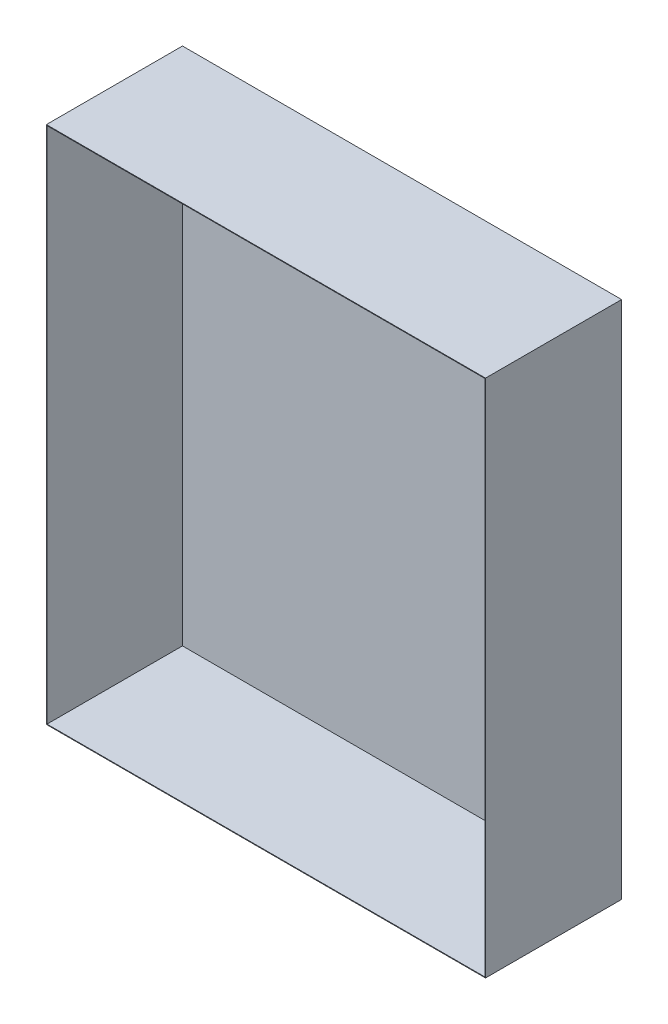
ISO-10303-21;
HEADER;
FILE_DESCRIPTION(('STEP AP214'),'2;1');
FILE_NAME('part.step','',(''),(''),'','','');
FILE_SCHEMA(('AUTOMOTIVE_DESIGN { 1 0 10303 214 1 1 1 1 }'));
ENDSEC;
DATA;
#1=APPLICATION_CONTEXT('core data for automotive mechanical design processes');
#2=APPLICATION_PROTOCOL_DEFINITION('international standard','automotive_design',2000,#1);
#3=PRODUCT_CONTEXT('',#1,'mechanical');
#4=PRODUCT('Part','Part','',(#3));
#5=PRODUCT_RELATED_PRODUCT_CATEGORY('part','',(#4));
#6=PRODUCT_DEFINITION_FORMATION('','',#4);
#7=PRODUCT_DEFINITION_CONTEXT('part definition',#1,'design');
#8=PRODUCT_DEFINITION('design','',#6,#7);
#9=PRODUCT_DEFINITION_SHAPE('','',#8);
#10=(LENGTH_UNIT() NAMED_UNIT(*) SI_UNIT(.MILLI.,.METRE.));
#11=(NAMED_UNIT(*) PLANE_ANGLE_UNIT() SI_UNIT($,.RADIAN.));
#12=(NAMED_UNIT(*) SI_UNIT($,.STERADIAN.) SOLID_ANGLE_UNIT());
#13=UNCERTAINTY_MEASURE_WITH_UNIT(LENGTH_MEASURE(1.E-05),#10,'distance_accuracy_value','');
#14=(GEOMETRIC_REPRESENTATION_CONTEXT(3) GLOBAL_UNCERTAINTY_ASSIGNED_CONTEXT((#13)) GLOBAL_UNIT_ASSIGNED_CONTEXT((#10,
#11,#12)) REPRESENTATION_CONTEXT('',''));
#15=CARTESIAN_POINT('',(0.,0.,0.));
#16=DIRECTION('',(0.,0.,1.));
#17=DIRECTION('',(1.,0.,0.));
#18=AXIS2_PLACEMENT_3D('',#15,#16,#17);
#19=CARTESIAN_POINT('',(-901.7,2133.6,279.4));
#20=DIRECTION('',(0.,0.,-1.));
#21=DIRECTION('',(-1.,0.,0.));
#22=AXIS2_PLACEMENT_3D('',#19,#20,#21);
#23=PLANE('',#22);
#24=DIRECTION('',(1.,0.,0.));
#25=VECTOR('',#24,1.);
#26=CARTESIAN_POINT('',(-901.7,0.,279.4));
#27=LINE('',#26,#25);
#28=CARTESIAN_POINT('',(-901.7,0.,279.4));
#29=VERTEX_POINT('',#28);
#30=CARTESIAN_POINT('',(901.7,0.,279.4));
#31=VERTEX_POINT('',#30);
#32=EDGE_CURVE('E79',#29,#31,#27,.T.);
#33=ORIENTED_EDGE('',*,*,#32,.T.);
#34=DIRECTION('',(0.,-1.,0.));
#35=VECTOR('',#34,1.);
#36=CARTESIAN_POINT('',(901.7,2133.6,279.4));
#37=LINE('',#36,#35);
#38=CARTESIAN_POINT('',(901.7,2133.6,279.4));
#39=VERTEX_POINT('',#38);
#40=EDGE_CURVE('E151',#39,#31,#37,.T.);
#41=ORIENTED_EDGE('',*,*,#40,.F.);
#42=DIRECTION('',(1.,0.,0.));
#43=VECTOR('',#42,1.);
#44=CARTESIAN_POINT('',(-901.7,2133.6,279.4));
#45=LINE('',#44,#43);
#46=CARTESIAN_POINT('',(-901.7,2133.6,279.4));
#47=VERTEX_POINT('',#46);
#48=EDGE_CURVE('E58',#47,#39,#45,.T.);
#49=ORIENTED_EDGE('',*,*,#48,.F.);
#50=DIRECTION('',(0.,-1.,0.));
#51=VECTOR('',#50,1.);
#52=CARTESIAN_POINT('',(-901.7,2133.6,279.4));
#53=LINE('',#52,#51);
#54=EDGE_CURVE('E161',#47,#29,#53,.T.);
#55=ORIENTED_EDGE('',*,*,#54,.T.);
#56=EDGE_LOOP('',(#33,#41,#49,#55));
#57=FACE_BOUND('',#56,.T.);
#58=DIRECTION('',(1.,0.,0.));
#59=VECTOR('',#58,1.);
#60=CARTESIAN_POINT('',(0.,2.54,279.4));
#61=LINE('',#60,#59);
#62=CARTESIAN_POINT('',(-899.16,2.54,279.4));
#63=VERTEX_POINT('',#62);
#64=CARTESIAN_POINT('',(899.16,2.54,279.4));
#65=VERTEX_POINT('',#64);
#66=EDGE_CURVE('E132',#63,#65,#61,.T.);
#67=ORIENTED_EDGE('',*,*,#66,.F.);
#68=DIRECTION('',(0.,-1.,0.));
#69=VECTOR('',#68,1.);
#70=CARTESIAN_POINT('',(-899.16,2133.6,279.4));
#71=LINE('',#70,#69);
#72=CARTESIAN_POINT('',(-899.16,2131.06,279.4));
#73=VERTEX_POINT('',#72);
#74=EDGE_CURVE('E127',#73,#63,#71,.T.);
#75=ORIENTED_EDGE('',*,*,#74,.F.);
#76=DIRECTION('',(1.,0.,0.));
#77=VECTOR('',#76,1.);
#78=CARTESIAN_POINT('',(0.,2131.06,279.4));
#79=LINE('',#78,#77);
#80=CARTESIAN_POINT('',(899.16,2131.06,279.4));
#81=VERTEX_POINT('',#80);
#82=EDGE_CURVE('E49',#73,#81,#79,.T.);
#83=ORIENTED_EDGE('',*,*,#82,.T.);
#84=DIRECTION('',(0.,-1.,0.));
#85=VECTOR('',#84,1.);
#86=CARTESIAN_POINT('',(899.16,2133.6,279.4));
#87=LINE('',#86,#85);
#88=EDGE_CURVE('E140',#81,#65,#87,.T.);
#89=ORIENTED_EDGE('',*,*,#88,.T.);
#90=EDGE_LOOP('',(#67,#75,#83,#89));
#91=FACE_BOUND('',#90,.T.);
#92=ADVANCED_FACE('F34',(#57,#91),#23,.F.);
#93=CARTESIAN_POINT('',(901.7,2133.6,279.4));
#94=DIRECTION('',(-1.,0.,0.));
#95=DIRECTION('',(0.,0.,1.));
#96=AXIS2_PLACEMENT_3D('',#93,#94,#95);
#97=PLANE('',#96);
#98=DIRECTION('',(0.,0.,-1.));
#99=VECTOR('',#98,1.);
#100=CARTESIAN_POINT('',(901.7,0.,279.4));
#101=LINE('',#100,#99);
#102=CARTESIAN_POINT('',(901.7,0.,-279.4));
#103=VERTEX_POINT('',#102);
#104=EDGE_CURVE('E152',#31,#103,#101,.T.);
#105=ORIENTED_EDGE('',*,*,#104,.T.);
#106=DIRECTION('',(0.,-1.,0.));
#107=VECTOR('',#106,1.);
#108=CARTESIAN_POINT('',(901.7,2133.6,-279.4));
#109=LINE('',#108,#107);
#110=CARTESIAN_POINT('',(901.7,2133.6,-279.4));
#111=VERTEX_POINT('',#110);
#112=EDGE_CURVE('E11',#111,#103,#109,.T.);
#113=ORIENTED_EDGE('',*,*,#112,.F.);
#114=DIRECTION('',(0.,0.,-1.));
#115=VECTOR('',#114,1.);
#116=CARTESIAN_POINT('',(901.7,2133.6,279.4));
#117=LINE('',#116,#115);
#118=EDGE_CURVE('E145',#39,#111,#117,.T.);
#119=ORIENTED_EDGE('',*,*,#118,.F.);
#120=ORIENTED_EDGE('',*,*,#40,.T.);
#121=EDGE_LOOP('',(#105,#113,#119,#120));
#122=FACE_BOUND('',#121,.T.);
#123=ADVANCED_FACE('F36',(#122),#97,.F.);
#124=CARTESIAN_POINT('',(-901.7,2133.6,-279.4));
#125=DIRECTION('',(0.,0.,1.));
#126=DIRECTION('',(1.,0.,0.));
#127=AXIS2_PLACEMENT_3D('',#124,#125,#126);
#128=PLANE('',#127);
#129=DIRECTION('',(-1.,0.,0.));
#130=VECTOR('',#129,1.);
#131=CARTESIAN_POINT('',(-901.7,0.,-279.4));
#132=LINE('',#131,#130);
#133=CARTESIAN_POINT('',(-901.7,0.,-279.4));
#134=VERTEX_POINT('',#133);
#135=EDGE_CURVE('E155',#103,#134,#132,.T.);
#136=ORIENTED_EDGE('',*,*,#135,.T.);
#137=DIRECTION('',(0.,-1.,0.));
#138=VECTOR('',#137,1.);
#139=CARTESIAN_POINT('',(-901.7,2133.6,-279.4));
#140=LINE('',#139,#138);
#141=CARTESIAN_POINT('',(-901.7,2133.6,-279.4));
#142=VERTEX_POINT('',#141);
#143=EDGE_CURVE('E42',#142,#134,#140,.T.);
#144=ORIENTED_EDGE('',*,*,#143,.F.);
#145=DIRECTION('',(-1.,0.,0.));
#146=VECTOR('',#145,1.);
#147=CARTESIAN_POINT('',(-901.7,2133.6,-279.4));
#148=LINE('',#147,#146);
#149=EDGE_CURVE('E86',#111,#142,#148,.T.);
#150=ORIENTED_EDGE('',*,*,#149,.F.);
#151=ORIENTED_EDGE('',*,*,#112,.T.);
#152=EDGE_LOOP('',(#136,#144,#150,#151));
#153=FACE_BOUND('',#152,.T.);
#154=ADVANCED_FACE('F200',(#153),#128,.F.);
#155=CARTESIAN_POINT('',(-901.7,2133.6,279.4));
#156=DIRECTION('',(1.,0.,0.));
#157=DIRECTION('',(0.,0.,-1.));
#158=AXIS2_PLACEMENT_3D('',#155,#156,#157);
#159=PLANE('',#158);
#160=DIRECTION('',(0.,0.,1.));
#161=VECTOR('',#160,1.);
#162=CARTESIAN_POINT('',(-901.7,0.,279.4));
#163=LINE('',#162,#161);
#164=EDGE_CURVE('E157',#134,#29,#163,.T.);
#165=ORIENTED_EDGE('',*,*,#164,.T.);
#166=ORIENTED_EDGE('',*,*,#54,.F.);
#167=DIRECTION('',(0.,0.,1.));
#168=VECTOR('',#167,1.);
#169=CARTESIAN_POINT('',(-901.7,2133.6,279.4));
#170=LINE('',#169,#168);
#171=EDGE_CURVE('E148',#142,#47,#170,.T.);
#172=ORIENTED_EDGE('',*,*,#171,.F.);
#173=ORIENTED_EDGE('',*,*,#143,.T.);
#174=EDGE_LOOP('',(#165,#166,#172,#173));
#175=FACE_BOUND('',#174,.T.);
#176=ADVANCED_FACE('F166',(#175),#159,.F.);
#177=CARTESIAN_POINT('',(0.,2133.6,0.));
#178=DIRECTION('',(0.,-1.,0.));
#179=DIRECTION('',(0.,0.,-1.));
#180=AXIS2_PLACEMENT_3D('',#177,#178,#179);
#181=PLANE('',#180);
#182=ORIENTED_EDGE('',*,*,#118,.T.);
#183=ORIENTED_EDGE('',*,*,#149,.T.);
#184=ORIENTED_EDGE('',*,*,#171,.T.);
#185=ORIENTED_EDGE('',*,*,#48,.T.);
#186=EDGE_LOOP('',(#182,#183,#184,#185));
#187=FACE_BOUND('',#186,.T.);
#188=ADVANCED_FACE('F194',(#187),#181,.F.);
#189=CARTESIAN_POINT('',(0.,0.,0.));
#190=DIRECTION('',(0.,-1.,0.));
#191=DIRECTION('',(0.,0.,-1.));
#192=AXIS2_PLACEMENT_3D('',#189,#190,#191);
#193=PLANE('',#192);
#194=ORIENTED_EDGE('',*,*,#104,.F.);
#195=ORIENTED_EDGE('',*,*,#32,.F.);
#196=ORIENTED_EDGE('',*,*,#164,.F.);
#197=ORIENTED_EDGE('',*,*,#135,.F.);
#198=EDGE_LOOP('',(#194,#195,#196,#197));
#199=FACE_BOUND('',#198,.T.);
#200=ADVANCED_FACE('F170',(#199),#193,.T.);
#201=CARTESIAN_POINT('',(899.16,2133.6,279.4));
#202=DIRECTION('',(-1.,0.,0.));
#203=DIRECTION('',(0.,0.,1.));
#204=AXIS2_PLACEMENT_3D('',#201,#202,#203);
#205=PLANE('',#204);
#206=DIRECTION('',(0.,0.,-1.));
#207=VECTOR('',#206,1.);
#208=CARTESIAN_POINT('',(899.16,2.54,0.));
#209=LINE('',#208,#207);
#210=CARTESIAN_POINT('',(899.16,2.54,-276.86));
#211=VERTEX_POINT('',#210);
#212=EDGE_CURVE('E116',#65,#211,#209,.T.);
#213=ORIENTED_EDGE('',*,*,#212,.F.);
#214=ORIENTED_EDGE('',*,*,#88,.F.);
#215=DIRECTION('',(0.,0.,-1.));
#216=VECTOR('',#215,1.);
#217=CARTESIAN_POINT('',(899.16,2131.06,0.));
#218=LINE('',#217,#216);
#219=CARTESIAN_POINT('',(899.16,2131.06,-276.86));
#220=VERTEX_POINT('',#219);
#221=EDGE_CURVE('E134',#81,#220,#218,.T.);
#222=ORIENTED_EDGE('',*,*,#221,.T.);
#223=DIRECTION('',(0.,-1.,0.));
#224=VECTOR('',#223,1.);
#225=CARTESIAN_POINT('',(899.16,2133.6,-276.86));
#226=LINE('',#225,#224);
#227=EDGE_CURVE('E126',#220,#211,#226,.T.);
#228=ORIENTED_EDGE('',*,*,#227,.T.);
#229=EDGE_LOOP('',(#213,#214,#222,#228));
#230=FACE_BOUND('',#229,.T.);
#231=ADVANCED_FACE('F178',(#230),#205,.T.);
#232=CARTESIAN_POINT('',(-901.7,2133.6,-276.86));
#233=DIRECTION('',(0.,0.,1.));
#234=DIRECTION('',(1.,0.,0.));
#235=AXIS2_PLACEMENT_3D('',#232,#233,#234);
#236=PLANE('',#235);
#237=DIRECTION('',(-1.,0.,0.));
#238=VECTOR('',#237,1.);
#239=CARTESIAN_POINT('',(0.,2.54,-276.86));
#240=LINE('',#239,#238);
#241=CARTESIAN_POINT('',(-899.16,2.54,-276.86));
#242=VERTEX_POINT('',#241);
#243=EDGE_CURVE('E109',#211,#242,#240,.T.);
#244=ORIENTED_EDGE('',*,*,#243,.F.);
#245=ORIENTED_EDGE('',*,*,#227,.F.);
#246=DIRECTION('',(-1.,0.,0.));
#247=VECTOR('',#246,1.);
#248=CARTESIAN_POINT('',(0.,2131.06,-276.86));
#249=LINE('',#248,#247);
#250=CARTESIAN_POINT('',(-899.16,2131.06,-276.86));
#251=VERTEX_POINT('',#250);
#252=EDGE_CURVE('E124',#220,#251,#249,.T.);
#253=ORIENTED_EDGE('',*,*,#252,.T.);
#254=DIRECTION('',(0.,-1.,0.));
#255=VECTOR('',#254,1.);
#256=CARTESIAN_POINT('',(-899.16,2133.6,-276.86));
#257=LINE('',#256,#255);
#258=EDGE_CURVE('E122',#251,#242,#257,.T.);
#259=ORIENTED_EDGE('',*,*,#258,.T.);
#260=EDGE_LOOP('',(#244,#245,#253,#259));
#261=FACE_BOUND('',#260,.T.);
#262=ADVANCED_FACE('F123',(#261),#236,.T.);
#263=CARTESIAN_POINT('',(-899.16,2133.6,279.4));
#264=DIRECTION('',(1.,0.,0.));
#265=DIRECTION('',(0.,0.,-1.));
#266=AXIS2_PLACEMENT_3D('',#263,#264,#265);
#267=PLANE('',#266);
#268=DIRECTION('',(0.,0.,1.));
#269=VECTOR('',#268,1.);
#270=CARTESIAN_POINT('',(-899.16,2.54,0.));
#271=LINE('',#270,#269);
#272=EDGE_CURVE('E113',#242,#63,#271,.T.);
#273=ORIENTED_EDGE('',*,*,#272,.F.);
#274=ORIENTED_EDGE('',*,*,#258,.F.);
#275=DIRECTION('',(0.,0.,1.));
#276=VECTOR('',#275,1.);
#277=CARTESIAN_POINT('',(-899.16,2131.06,0.));
#278=LINE('',#277,#276);
#279=EDGE_CURVE('E138',#251,#73,#278,.T.);
#280=ORIENTED_EDGE('',*,*,#279,.T.);
#281=ORIENTED_EDGE('',*,*,#74,.T.);
#282=EDGE_LOOP('',(#273,#274,#280,#281));
#283=FACE_BOUND('',#282,.T.);
#284=ADVANCED_FACE('F129',(#283),#267,.T.);
#285=CARTESIAN_POINT('',(0.,2131.06,0.));
#286=DIRECTION('',(0.,-1.,0.));
#287=DIRECTION('',(0.,0.,-1.));
#288=AXIS2_PLACEMENT_3D('',#285,#286,#287);
#289=PLANE('',#288);
#290=ORIENTED_EDGE('',*,*,#221,.F.);
#291=ORIENTED_EDGE('',*,*,#82,.F.);
#292=ORIENTED_EDGE('',*,*,#279,.F.);
#293=ORIENTED_EDGE('',*,*,#252,.F.);
#294=EDGE_LOOP('',(#290,#291,#292,#293));
#295=FACE_BOUND('',#294,.T.);
#296=ADVANCED_FACE('F183',(#295),#289,.T.);
#297=CARTESIAN_POINT('',(0.,2.54,0.));
#298=DIRECTION('',(0.,-1.,0.));
#299=DIRECTION('',(0.,0.,-1.));
#300=AXIS2_PLACEMENT_3D('',#297,#298,#299);
#301=PLANE('',#300);
#302=ORIENTED_EDGE('',*,*,#212,.T.);
#303=ORIENTED_EDGE('',*,*,#243,.T.);
#304=ORIENTED_EDGE('',*,*,#272,.T.);
#305=ORIENTED_EDGE('',*,*,#66,.T.);
#306=EDGE_LOOP('',(#302,#303,#304,#305));
#307=FACE_BOUND('',#306,.T.);
#308=ADVANCED_FACE('F111',(#307),#301,.F.);
#309=CLOSED_SHELL('',(#92,#123,#154,#176,#188,#200,#231,#262,#284,#296,#308));
#310=MANIFOLD_SOLID_BREP('B2',#309);
#311=ADVANCED_BREP_SHAPE_REPRESENTATION('',(#18,#310),#14);
#312=SHAPE_DEFINITION_REPRESENTATION(#9,#311);
ENDSEC;
END-ISO-10303-21;
